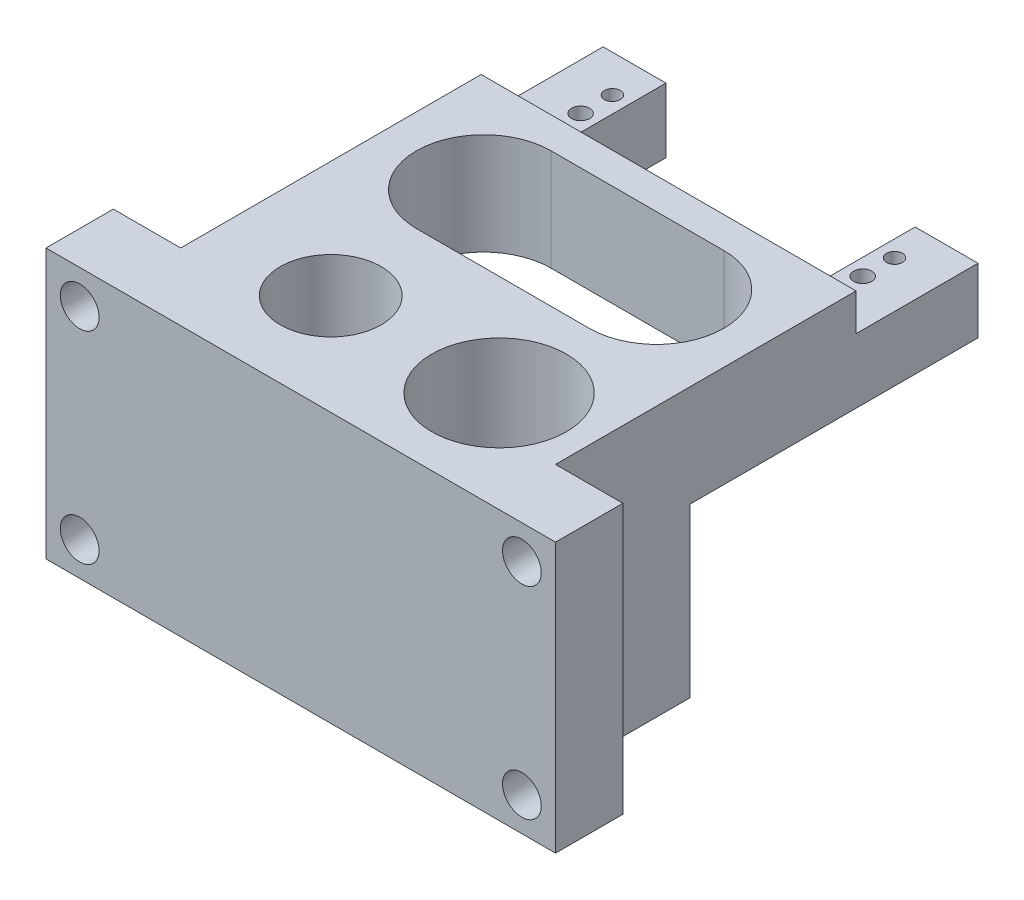
ISO-10303-21;
HEADER;
FILE_DESCRIPTION(('STEP AP214'),'2;1');
FILE_NAME('part.step','',(''),(''),'','','');
FILE_SCHEMA(('AUTOMOTIVE_DESIGN { 1 0 10303 214 1 1 1 1 }'));
ENDSEC;
DATA;
#1=APPLICATION_CONTEXT('core data for automotive mechanical design processes');
#2=APPLICATION_PROTOCOL_DEFINITION('international standard','automotive_design',2000,#1);
#3=PRODUCT_CONTEXT('',#1,'mechanical');
#4=PRODUCT('Part','Part','',(#3));
#5=PRODUCT_RELATED_PRODUCT_CATEGORY('part','',(#4));
#6=PRODUCT_DEFINITION_FORMATION('','',#4);
#7=PRODUCT_DEFINITION_CONTEXT('part definition',#1,'design');
#8=PRODUCT_DEFINITION('design','',#6,#7);
#9=PRODUCT_DEFINITION_SHAPE('','',#8);
#10=(LENGTH_UNIT() NAMED_UNIT(*) SI_UNIT(.MILLI.,.METRE.));
#11=(NAMED_UNIT(*) PLANE_ANGLE_UNIT() SI_UNIT($,.RADIAN.));
#12=(NAMED_UNIT(*) SI_UNIT($,.STERADIAN.) SOLID_ANGLE_UNIT());
#13=UNCERTAINTY_MEASURE_WITH_UNIT(LENGTH_MEASURE(1.E-05),#10,'distance_accuracy_value','');
#14=(GEOMETRIC_REPRESENTATION_CONTEXT(3) GLOBAL_UNCERTAINTY_ASSIGNED_CONTEXT((#13)) GLOBAL_UNIT_ASSIGNED_CONTEXT((#10,
#11,#12)) REPRESENTATION_CONTEXT('',''));
#15=CARTESIAN_POINT('',(0.,0.,0.));
#16=DIRECTION('',(0.,0.,1.));
#17=DIRECTION('',(1.,0.,0.));
#18=AXIS2_PLACEMENT_3D('',#15,#16,#17);
#19=CARTESIAN_POINT('',(0.,0.,-25.1625));
#20=DIRECTION('',(0.,0.,1.));
#21=DIRECTION('',(1.,0.,0.));
#22=AXIS2_PLACEMENT_3D('',#19,#20,#21);
#23=PLANE('',#22);
#24=DIRECTION('',(1.,0.,0.));
#25=VECTOR('',#24,1.);
#26=CARTESIAN_POINT('',(-5.05000000000001,21.9085,-25.1625));
#27=LINE('',#26,#25);
#28=CARTESIAN_POINT('',(-10.975,21.9085,-25.1625));
#29=VERTEX_POINT('',#28);
#30=CARTESIAN_POINT('',(-5.05000000000001,21.9085,-25.1625));
#31=VERTEX_POINT('',#30);
#32=EDGE_CURVE('E69',#29,#31,#27,.T.);
#33=ORIENTED_EDGE('',*,*,#32,.F.);
#34=DIRECTION('',(0.,1.,0.));
#35=VECTOR('',#34,1.);
#36=CARTESIAN_POINT('',(-10.975,25.4,-25.1625));
#37=LINE('',#36,#35);
#38=CARTESIAN_POINT('',(-10.975,25.4,-25.1625));
#39=VERTEX_POINT('',#38);
#40=EDGE_CURVE('E359',#29,#39,#37,.T.);
#41=ORIENTED_EDGE('',*,*,#40,.T.);
#42=DIRECTION('',(1.,0.,0.));
#43=VECTOR('',#42,1.);
#44=CARTESIAN_POINT('',(24.375,25.4,-25.1625));
#45=LINE('',#44,#43);
#46=CARTESIAN_POINT('',(24.375,25.4,-25.1625));
#47=VERTEX_POINT('',#46);
#48=EDGE_CURVE('E362',#39,#47,#45,.T.);
#49=ORIENTED_EDGE('',*,*,#48,.T.);
#50=DIRECTION('',(0.,-1.,0.));
#51=VECTOR('',#50,1.);
#52=CARTESIAN_POINT('',(24.375,15.8125,-25.1625));
#53=LINE('',#52,#51);
#54=CARTESIAN_POINT('',(24.375,21.9085,-25.1625));
#55=VERTEX_POINT('',#54);
#56=EDGE_CURVE('E365',#47,#55,#53,.T.);
#57=ORIENTED_EDGE('',*,*,#56,.T.);
#58=DIRECTION('',(1.,0.,0.));
#59=VECTOR('',#58,1.);
#60=CARTESIAN_POINT('',(24.375,21.9085,-25.1625));
#61=LINE('',#60,#59);
#62=CARTESIAN_POINT('',(18.45,21.9085,-25.1625));
#63=VERTEX_POINT('',#62);
#64=EDGE_CURVE('E289',#63,#55,#61,.T.);
#65=ORIENTED_EDGE('',*,*,#64,.F.);
#66=DIRECTION('',(0.,1.,0.));
#67=VECTOR('',#66,1.);
#68=CARTESIAN_POINT('',(18.45,21.9085,-25.1625));
#69=LINE('',#68,#67);
#70=CARTESIAN_POINT('',(18.45,15.8125,-25.1625));
#71=VERTEX_POINT('',#70);
#72=EDGE_CURVE('E284',#71,#63,#69,.T.);
#73=ORIENTED_EDGE('',*,*,#72,.F.);
#74=DIRECTION('',(-1.,0.,0.));
#75=VECTOR('',#74,1.);
#76=CARTESIAN_POINT('',(-10.975,15.8125,-25.1625));
#77=LINE('',#76,#75);
#78=CARTESIAN_POINT('',(-5.05000000000001,15.8125,-25.1625));
#79=VERTEX_POINT('',#78);
#80=EDGE_CURVE('E357',#71,#79,#77,.T.);
#81=ORIENTED_EDGE('',*,*,#80,.T.);
#82=DIRECTION('',(0.,-1.,0.));
#83=VECTOR('',#82,1.);
#84=CARTESIAN_POINT('',(-5.05000000000001,15.8125,-25.1625));
#85=LINE('',#84,#83);
#86=EDGE_CURVE('E64',#31,#79,#85,.T.);
#87=ORIENTED_EDGE('',*,*,#86,.F.);
#88=EDGE_LOOP('',(#33,#41,#49,#57,#65,#73,#81,#87));
#89=FACE_BOUND('',#88,.T.);
#90=ADVANCED_FACE('F46',(#89),#23,.F.);
#91=CARTESIAN_POINT('',(24.375,25.4,-16.74375));
#92=DIRECTION('',(-1.,0.,0.));
#93=DIRECTION('',(0.,0.,1.));
#94=AXIS2_PLACEMENT_3D('',#91,#92,#93);
#95=PLANE('',#94);
#96=DIRECTION('',(0.,0.,1.));
#97=VECTOR('',#96,1.);
#98=CARTESIAN_POINT('',(24.375,15.8125,-16.74375));
#99=LINE('',#98,#97);
#100=CARTESIAN_POINT('',(24.375,15.8125,-36.6625));
#101=VERTEX_POINT('',#100);
#102=CARTESIAN_POINT('',(24.375,15.8125,-9.525));
#103=VERTEX_POINT('',#102);
#104=EDGE_CURVE('E400',#101,#103,#99,.T.);
#105=ORIENTED_EDGE('',*,*,#104,.F.);
#106=DIRECTION('',(0.,-1.,0.));
#107=VECTOR('',#106,1.);
#108=CARTESIAN_POINT('',(24.375,15.8125,-36.6625));
#109=LINE('',#108,#107);
#110=CARTESIAN_POINT('',(24.375,21.9085,-36.6625));
#111=VERTEX_POINT('',#110);
#112=EDGE_CURVE('E285',#111,#101,#109,.T.);
#113=ORIENTED_EDGE('',*,*,#112,.F.);
#114=DIRECTION('',(0.,0.,1.));
#115=VECTOR('',#114,1.);
#116=CARTESIAN_POINT('',(24.375,21.9085,-36.6625));
#117=LINE('',#116,#115);
#118=EDGE_CURVE('E295',#111,#55,#117,.T.);
#119=ORIENTED_EDGE('',*,*,#118,.T.);
#120=ORIENTED_EDGE('',*,*,#56,.F.);
#121=DIRECTION('',(0.,0.,-1.));
#122=VECTOR('',#121,1.);
#123=CARTESIAN_POINT('',(24.375,25.4,-13.56875));
#124=LINE('',#123,#122);
#125=CARTESIAN_POINT('',(24.375,25.4,3.175));
#126=VERTEX_POINT('',#125);
#127=EDGE_CURVE('E378',#47,#126,#124,.F.);
#128=ORIENTED_EDGE('',*,*,#127,.T.);
#129=DIRECTION('',(0.,1.,0.));
#130=VECTOR('',#129,1.);
#131=CARTESIAN_POINT('',(24.375,25.4,3.175));
#132=LINE('',#131,#130);
#133=CARTESIAN_POINT('',(24.375,0.,3.17499999999999));
#134=VERTEX_POINT('',#133);
#135=EDGE_CURVE('E396',#126,#134,#132,.F.);
#136=ORIENTED_EDGE('',*,*,#135,.T.);
#137=DIRECTION('',(0.,0.,1.));
#138=VECTOR('',#137,1.);
#139=CARTESIAN_POINT('',(24.375,0.,3.17499999999999));
#140=LINE('',#139,#138);
#141=CARTESIAN_POINT('',(24.375,0.,-9.52500000000001));
#142=VERTEX_POINT('',#141);
#143=EDGE_CURVE('E346',#142,#134,#140,.T.);
#144=ORIENTED_EDGE('',*,*,#143,.F.);
#145=DIRECTION('',(0.,1.,0.));
#146=VECTOR('',#145,1.);
#147=CARTESIAN_POINT('',(24.375,0.,-9.52500000000001));
#148=LINE('',#147,#146);
#149=EDGE_CURVE('E348',#142,#103,#148,.T.);
#150=ORIENTED_EDGE('',*,*,#149,.T.);
#151=EDGE_LOOP('',(#105,#113,#119,#120,#128,#136,#144,#150));
#152=FACE_BOUND('',#151,.T.);
#153=ADVANCED_FACE('F541',(#152),#95,.F.);
#154=CARTESIAN_POINT('',(-10.975,25.4,-16.74375));
#155=DIRECTION('',(-1.,0.,0.));
#156=DIRECTION('',(0.,0.,1.));
#157=AXIS2_PLACEMENT_3D('',#154,#155,#156);
#158=PLANE('',#157);
#159=DIRECTION('',(0.,0.,-1.));
#160=VECTOR('',#159,1.);
#161=CARTESIAN_POINT('',(-10.975,25.4,-13.56875));
#162=LINE('',#161,#160);
#163=CARTESIAN_POINT('',(-10.975,25.4,3.175));
#164=VERTEX_POINT('',#163);
#165=EDGE_CURVE('E393',#164,#39,#162,.T.);
#166=ORIENTED_EDGE('',*,*,#165,.T.);
#167=ORIENTED_EDGE('',*,*,#40,.F.);
#168=DIRECTION('',(0.,0.,1.));
#169=VECTOR('',#168,1.);
#170=CARTESIAN_POINT('',(-10.975,21.9085,-36.6625));
#171=LINE('',#170,#169);
#172=CARTESIAN_POINT('',(-10.975,21.9085,-36.6625));
#173=VERTEX_POINT('',#172);
#174=EDGE_CURVE('E274',#173,#29,#171,.T.);
#175=ORIENTED_EDGE('',*,*,#174,.F.);
#176=DIRECTION('',(0.,1.,0.));
#177=VECTOR('',#176,1.);
#178=CARTESIAN_POINT('',(-10.975,21.9085,-36.6625));
#179=LINE('',#178,#177);
#180=CARTESIAN_POINT('',(-10.975,15.8125,-36.6625));
#181=VERTEX_POINT('',#180);
#182=EDGE_CURVE('E272',#181,#173,#179,.T.);
#183=ORIENTED_EDGE('',*,*,#182,.F.);
#184=DIRECTION('',(0.,0.,1.));
#185=VECTOR('',#184,1.);
#186=CARTESIAN_POINT('',(-10.975,15.8125,-16.74375));
#187=LINE('',#186,#185);
#188=CARTESIAN_POINT('',(-10.975,15.8125,-9.525));
#189=VERTEX_POINT('',#188);
#190=EDGE_CURVE('E394',#181,#189,#187,.T.);
#191=ORIENTED_EDGE('',*,*,#190,.T.);
#192=DIRECTION('',(0.,1.,0.));
#193=VECTOR('',#192,1.);
#194=CARTESIAN_POINT('',(-10.975,0.,-9.52500000000001));
#195=LINE('',#194,#193);
#196=CARTESIAN_POINT('',(-10.975,0.,-9.52500000000001));
#197=VERTEX_POINT('',#196);
#198=EDGE_CURVE('E353',#197,#189,#195,.T.);
#199=ORIENTED_EDGE('',*,*,#198,.F.);
#200=DIRECTION('',(0.,0.,-1.));
#201=VECTOR('',#200,1.);
#202=CARTESIAN_POINT('',(-10.975,0.,-9.52500000000001));
#203=LINE('',#202,#201);
#204=CARTESIAN_POINT('',(-10.975,0.,3.175));
#205=VERTEX_POINT('',#204);
#206=EDGE_CURVE('E341',#205,#197,#203,.T.);
#207=ORIENTED_EDGE('',*,*,#206,.F.);
#208=DIRECTION('',(0.,1.,0.));
#209=VECTOR('',#208,1.);
#210=CARTESIAN_POINT('',(-10.975,25.4,3.175));
#211=LINE('',#210,#209);
#212=EDGE_CURVE('E388',#205,#164,#211,.T.);
#213=ORIENTED_EDGE('',*,*,#212,.T.);
#214=EDGE_LOOP('',(#166,#167,#175,#183,#191,#199,#207,#213));
#215=FACE_BOUND('',#214,.T.);
#216=ADVANCED_FACE('F551',(#215),#158,.T.);
#217=CARTESIAN_POINT('',(50.8,7.90625,-9.525));
#218=DIRECTION('',(0.,0.,1.));
#219=DIRECTION('',(1.,0.,0.));
#220=AXIS2_PLACEMENT_3D('',#217,#218,#219);
#221=PLANE('',#220);
#222=DIRECTION('',(0.,1.,0.));
#223=VECTOR('',#222,1.);
#224=CARTESIAN_POINT('',(14.85,7.90625,-9.525));
#225=LINE('',#224,#223);
#226=CARTESIAN_POINT('',(14.85,15.8125,-9.525));
#227=VERTEX_POINT('',#226);
#228=CARTESIAN_POINT('',(14.85,25.4,-9.525));
#229=VERTEX_POINT('',#228);
#230=EDGE_CURVE('E514',#227,#229,#225,.T.);
#231=ORIENTED_EDGE('',*,*,#230,.F.);
#232=DIRECTION('',(1.,0.,0.));
#233=VECTOR('',#232,1.);
#234=CARTESIAN_POINT('',(24.375,15.8125,-9.525));
#235=LINE('',#234,#233);
#236=EDGE_CURVE('E12',#227,#103,#235,.T.);
#237=ORIENTED_EDGE('',*,*,#236,.T.);
#238=ORIENTED_EDGE('',*,*,#149,.F.);
#239=DIRECTION('',(1.,0.,0.));
#240=VECTOR('',#239,1.);
#241=CARTESIAN_POINT('',(24.375,0.,-9.52500000000001));
#242=LINE('',#241,#240);
#243=EDGE_CURVE('E344',#197,#142,#242,.T.);
#244=ORIENTED_EDGE('',*,*,#243,.F.);
#245=ORIENTED_EDGE('',*,*,#198,.T.);
#246=CARTESIAN_POINT('',(-1.45,15.8125,-9.525));
#247=VERTEX_POINT('',#246);
#248=EDGE_CURVE('E57',#189,#247,#235,.T.);
#249=ORIENTED_EDGE('',*,*,#248,.T.);
#250=DIRECTION('',(0.,1.,0.));
#251=VECTOR('',#250,1.);
#252=CARTESIAN_POINT('',(-1.45,7.90625,-9.525));
#253=LINE('',#252,#251);
#254=CARTESIAN_POINT('',(-1.45,25.4,-9.525));
#255=VERTEX_POINT('',#254);
#256=EDGE_CURVE('E517',#255,#247,#253,.F.);
#257=ORIENTED_EDGE('',*,*,#256,.F.);
#258=DIRECTION('',(1.,0.,0.));
#259=VECTOR('',#258,1.);
#260=CARTESIAN_POINT('',(6.7,25.4,-9.525));
#261=LINE('',#260,#259);
#262=EDGE_CURVE('E372',#255,#229,#261,.T.);
#263=ORIENTED_EDGE('',*,*,#262,.T.);
#264=EDGE_LOOP('',(#231,#237,#238,#244,#245,#249,#257,#263));
#265=FACE_BOUND('',#264,.T.);
#266=ADVANCED_FACE('F539',(#265),#221,.F.);
#267=CARTESIAN_POINT('',(50.8,15.8125,-23.09375));
#268=DIRECTION('',(0.,-1.,0.));
#269=DIRECTION('',(0.,0.,-1.));
#270=AXIS2_PLACEMENT_3D('',#267,#268,#269);
#271=PLANE('',#270);
#272=CARTESIAN_POINT('',(20.,15.8125,-33.1625));
#273=DIRECTION('',(0.,-1.,0.));
#274=DIRECTION('',(0.,0.,-1.));
#275=AXIS2_PLACEMENT_3D('',#272,#273,#274);
#276=CIRCLE('',#275,0.749999999999989);
#277=CARTESIAN_POINT('',(20.,15.8125,-33.9125));
#278=VERTEX_POINT('',#277);
#279=EDGE_CURVE('E50',#278,#278,#276,.T.);
#280=ORIENTED_EDGE('',*,*,#279,.F.);
#281=EDGE_LOOP('',(#280));
#282=FACE_BOUND('',#281,.T.);
#283=CARTESIAN_POINT('',(-6.6,15.8125,-33.1625));
#284=DIRECTION('',(0.,-1.,0.));
#285=DIRECTION('',(0.,0.,-1.));
#286=AXIS2_PLACEMENT_3D('',#283,#284,#285);
#287=CIRCLE('',#286,0.749999999999987);
#288=CARTESIAN_POINT('',(-6.6,15.8125,-33.9125));
#289=VERTEX_POINT('',#288);
#290=EDGE_CURVE('E645',#289,#289,#287,.T.);
#291=ORIENTED_EDGE('',*,*,#290,.F.);
#292=EDGE_LOOP('',(#291));
#293=FACE_BOUND('',#292,.T.);
#294=CARTESIAN_POINT('',(20.,15.8125,-30.1625));
#295=DIRECTION('',(0.,-1.,0.));
#296=DIRECTION('',(0.,0.,-1.));
#297=AXIS2_PLACEMENT_3D('',#294,#295,#296);
#298=CIRCLE('',#297,0.849999999999986);
#299=CARTESIAN_POINT('',(20.,15.8125,-31.0124999999999));
#300=VERTEX_POINT('',#299);
#301=EDGE_CURVE('E649',#300,#300,#298,.T.);
#302=ORIENTED_EDGE('',*,*,#301,.F.);
#303=EDGE_LOOP('',(#302));
#304=FACE_BOUND('',#303,.T.);
#305=CARTESIAN_POINT('',(-6.6,15.8125,-30.1625));
#306=DIRECTION('',(0.,-1.,0.));
#307=DIRECTION('',(0.,0.,-1.));
#308=AXIS2_PLACEMENT_3D('',#305,#306,#307);
#309=CIRCLE('',#308,0.849999999999988);
#310=CARTESIAN_POINT('',(-6.6,15.8125,-31.0124999999999));
#311=VERTEX_POINT('',#310);
#312=EDGE_CURVE('E652',#311,#311,#309,.T.);
#313=ORIENTED_EDGE('',*,*,#312,.F.);
#314=EDGE_LOOP('',(#313));
#315=FACE_BOUND('',#314,.T.);
#316=ORIENTED_EDGE('',*,*,#248,.F.);
#317=ORIENTED_EDGE('',*,*,#190,.F.);
#318=DIRECTION('',(-1.,0.,0.));
#319=VECTOR('',#318,1.);
#320=CARTESIAN_POINT('',(-10.975,15.8125,-36.6625));
#321=LINE('',#320,#319);
#322=CARTESIAN_POINT('',(-5.05000000000001,15.8125,-36.6625));
#323=VERTEX_POINT('',#322);
#324=EDGE_CURVE('E269',#323,#181,#321,.T.);
#325=ORIENTED_EDGE('',*,*,#324,.F.);
#326=DIRECTION('',(0.,0.,1.));
#327=VECTOR('',#326,1.);
#328=CARTESIAN_POINT('',(-5.05000000000001,15.8125,-36.6625));
#329=LINE('',#328,#327);
#330=EDGE_CURVE('E279',#323,#79,#329,.T.);
#331=ORIENTED_EDGE('',*,*,#330,.T.);
#332=ORIENTED_EDGE('',*,*,#80,.F.);
#333=DIRECTION('',(0.,0.,1.));
#334=VECTOR('',#333,1.);
#335=CARTESIAN_POINT('',(18.45,15.8125,-36.6625));
#336=LINE('',#335,#334);
#337=CARTESIAN_POINT('',(18.45,15.8125,-36.6625));
#338=VERTEX_POINT('',#337);
#339=EDGE_CURVE('E305',#338,#71,#336,.T.);
#340=ORIENTED_EDGE('',*,*,#339,.F.);
#341=DIRECTION('',(-1.,0.,0.));
#342=VECTOR('',#341,1.);
#343=CARTESIAN_POINT('',(18.45,15.8125,-36.6625));
#344=LINE('',#343,#342);
#345=EDGE_CURVE('E288',#101,#338,#344,.T.);
#346=ORIENTED_EDGE('',*,*,#345,.F.);
#347=ORIENTED_EDGE('',*,*,#104,.T.);
#348=ORIENTED_EDGE('',*,*,#236,.F.);
#349=CARTESIAN_POINT('',(14.85,15.8125,-15.875));
#350=DIRECTION('',(0.,-1.,0.));
#351=DIRECTION('',(0.,0.,-1.));
#352=AXIS2_PLACEMENT_3D('',#349,#350,#351);
#353=CIRCLE('',#352,6.35);
#354=CARTESIAN_POINT('',(14.85,15.8125,-22.225));
#355=VERTEX_POINT('',#354);
#356=EDGE_CURVE('E407',#227,#355,#353,.F.);
#357=ORIENTED_EDGE('',*,*,#356,.T.);
#358=DIRECTION('',(-1.,0.,0.));
#359=VECTOR('',#358,1.);
#360=CARTESIAN_POINT('',(-10.975,15.8125,-22.225));
#361=LINE('',#360,#359);
#362=CARTESIAN_POINT('',(-1.45,15.8125,-22.225));
#363=VERTEX_POINT('',#362);
#364=EDGE_CURVE('E356',#355,#363,#361,.T.);
#365=ORIENTED_EDGE('',*,*,#364,.T.);
#366=CARTESIAN_POINT('',(-1.45,15.8125,-15.875));
#367=DIRECTION('',(0.,-1.,0.));
#368=DIRECTION('',(0.,0.,-1.));
#369=AXIS2_PLACEMENT_3D('',#366,#367,#368);
#370=CIRCLE('',#369,6.35);
#371=EDGE_CURVE('E367',#363,#247,#370,.F.);
#372=ORIENTED_EDGE('',*,*,#371,.T.);
#373=EDGE_LOOP('',(#316,#317,#325,#331,#332,#340,#346,#347,#348,#357,#365,#372));
#374=FACE_BOUND('',#373,.T.);
#375=ADVANCED_FACE('F48',(#282,#293,#304,#315,#374),#271,.T.);
#376=CARTESIAN_POINT('',(-1.45,87.8064131172225,-15.875));
#377=DIRECTION('',(0.,-1.,0.));
#378=DIRECTION('',(0.,0.,-1.));
#379=AXIS2_PLACEMENT_3D('',#376,#377,#378);
#380=CYLINDRICAL_SURFACE('',#379,6.35);
#381=CARTESIAN_POINT('',(-1.45,25.4,-15.875));
#382=DIRECTION('',(0.,-1.,0.));
#383=DIRECTION('',(0.,0.,-1.));
#384=AXIS2_PLACEMENT_3D('',#381,#382,#383);
#385=CIRCLE('',#384,6.35);
#386=CARTESIAN_POINT('',(-1.45,25.4,-22.225));
#387=VERTEX_POINT('',#386);
#388=EDGE_CURVE('E377',#387,#255,#385,.F.);
#389=ORIENTED_EDGE('',*,*,#388,.T.);
#390=ORIENTED_EDGE('',*,*,#256,.T.);
#391=ORIENTED_EDGE('',*,*,#371,.F.);
#392=DIRECTION('',(0.,1.,0.));
#393=VECTOR('',#392,1.);
#394=CARTESIAN_POINT('',(-1.45,87.8064131172225,-22.225));
#395=LINE('',#394,#393);
#396=EDGE_CURVE('E406',#387,#363,#395,.F.);
#397=ORIENTED_EDGE('',*,*,#396,.F.);
#398=EDGE_LOOP('',(#389,#390,#391,#397));
#399=FACE_BOUND('',#398,.T.);
#400=ADVANCED_FACE('F620',(#399),#380,.F.);
#401=CARTESIAN_POINT('',(14.85,87.8064131172225,-15.875));
#402=DIRECTION('',(0.,-1.,0.));
#403=DIRECTION('',(0.,0.,-1.));
#404=AXIS2_PLACEMENT_3D('',#401,#402,#403);
#405=CYLINDRICAL_SURFACE('',#404,6.35);
#406=ORIENTED_EDGE('',*,*,#230,.T.);
#407=CARTESIAN_POINT('',(14.85,25.4,-15.875));
#408=DIRECTION('',(0.,-1.,0.));
#409=DIRECTION('',(0.,0.,-1.));
#410=AXIS2_PLACEMENT_3D('',#407,#408,#409);
#411=CIRCLE('',#410,6.35);
#412=CARTESIAN_POINT('',(14.85,25.4,-22.225));
#413=VERTEX_POINT('',#412);
#414=EDGE_CURVE('E55',#229,#413,#411,.F.);
#415=ORIENTED_EDGE('',*,*,#414,.T.);
#416=DIRECTION('',(0.,1.,0.));
#417=VECTOR('',#416,1.);
#418=CARTESIAN_POINT('',(14.85,87.8064131172225,-22.225));
#419=LINE('',#418,#417);
#420=EDGE_CURVE('E401',#355,#413,#419,.T.);
#421=ORIENTED_EDGE('',*,*,#420,.F.);
#422=ORIENTED_EDGE('',*,*,#356,.F.);
#423=EDGE_LOOP('',(#406,#415,#421,#422));
#424=FACE_BOUND('',#423,.T.);
#425=ADVANCED_FACE('F623',(#424),#405,.F.);
#426=CARTESIAN_POINT('',(6.7,25.4,-13.56875));
#427=DIRECTION('',(0.,-1.,0.));
#428=DIRECTION('',(0.,0.,-1.));
#429=AXIS2_PLACEMENT_3D('',#426,#427,#428);
#430=PLANE('',#429);
#431=CARTESIAN_POINT('',(15.875,25.4,0.));
#432=DIRECTION('',(0.,-1.,0.));
#433=DIRECTION('',(0.,0.,-1.));
#434=AXIS2_PLACEMENT_3D('',#431,#432,#433);
#435=CIRCLE('',#434,6.35000000000001);
#436=CARTESIAN_POINT('',(15.875,25.4,-6.35000000000001));
#437=VERTEX_POINT('',#436);
#438=EDGE_CURVE('E233',#437,#437,#435,.T.);
#439=ORIENTED_EDGE('',*,*,#438,.T.);
#440=EDGE_LOOP('',(#439));
#441=FACE_BOUND('',#440,.T.);
#442=CARTESIAN_POINT('',(0.,25.4,0.));
#443=DIRECTION('',(0.,1.,0.));
#444=DIRECTION('',(0.,0.,1.));
#445=AXIS2_PLACEMENT_3D('',#442,#443,#444);
#446=CIRCLE('',#445,4.76249999999999);
#447=CARTESIAN_POINT('',(0.,25.4,4.76249999999999));
#448=VERTEX_POINT('',#447);
#449=EDGE_CURVE('E236',#448,#448,#446,.T.);
#450=ORIENTED_EDGE('',*,*,#449,.F.);
#451=EDGE_LOOP('',(#450));
#452=FACE_BOUND('',#451,.T.);
#453=ORIENTED_EDGE('',*,*,#388,.F.);
#454=DIRECTION('',(1.,0.,0.));
#455=VECTOR('',#454,1.);
#456=CARTESIAN_POINT('',(24.375,25.4,-22.225));
#457=LINE('',#456,#455);
#458=EDGE_CURVE('E360',#387,#413,#457,.T.);
#459=ORIENTED_EDGE('',*,*,#458,.T.);
#460=ORIENTED_EDGE('',*,*,#414,.F.);
#461=ORIENTED_EDGE('',*,*,#262,.F.);
#462=EDGE_LOOP('',(#453,#459,#460,#461));
#463=FACE_BOUND('',#462,.T.);
#464=ORIENTED_EDGE('',*,*,#127,.F.);
#465=ORIENTED_EDGE('',*,*,#48,.F.);
#466=ORIENTED_EDGE('',*,*,#165,.F.);
#467=DIRECTION('',(-1.,0.,0.));
#468=VECTOR('',#467,1.);
#469=CARTESIAN_POINT('',(-17.325,25.4,3.175));
#470=LINE('',#469,#468);
#471=CARTESIAN_POINT('',(-17.325,25.4,3.175));
#472=VERTEX_POINT('',#471);
#473=EDGE_CURVE('E308',#164,#472,#470,.T.);
#474=ORIENTED_EDGE('',*,*,#473,.T.);
#475=DIRECTION('',(0.,0.,-1.));
#476=VECTOR('',#475,1.);
#477=CARTESIAN_POINT('',(-17.325,25.4,9.525));
#478=LINE('',#477,#476);
#479=CARTESIAN_POINT('',(-17.325,25.4,9.525));
#480=VERTEX_POINT('',#479);
#481=EDGE_CURVE('E338',#480,#472,#478,.T.);
#482=ORIENTED_EDGE('',*,*,#481,.F.);
#483=DIRECTION('',(-1.,0.,0.));
#484=VECTOR('',#483,1.);
#485=CARTESIAN_POINT('',(-17.325,25.4,9.525));
#486=LINE('',#485,#484);
#487=CARTESIAN_POINT('',(30.725,25.4,9.525));
#488=VERTEX_POINT('',#487);
#489=EDGE_CURVE('E309',#488,#480,#486,.T.);
#490=ORIENTED_EDGE('',*,*,#489,.F.);
#491=DIRECTION('',(0.,0.,-1.));
#492=VECTOR('',#491,1.);
#493=CARTESIAN_POINT('',(30.725,25.4,9.525));
#494=LINE('',#493,#492);
#495=CARTESIAN_POINT('',(30.725,25.4,3.175));
#496=VERTEX_POINT('',#495);
#497=EDGE_CURVE('E319',#488,#496,#494,.T.);
#498=ORIENTED_EDGE('',*,*,#497,.T.);
#499=EDGE_CURVE('E320',#496,#126,#470,.T.);
#500=ORIENTED_EDGE('',*,*,#499,.T.);
#501=EDGE_LOOP('',(#464,#465,#466,#474,#482,#490,#498,#500));
#502=FACE_BOUND('',#501,.T.);
#503=ADVANCED_FACE('F576',(#441,#452,#463,#502),#430,.F.);
#504=CARTESIAN_POINT('',(0.,0.,-22.225));
#505=DIRECTION('',(0.,0.,1.));
#506=DIRECTION('',(1.,0.,0.));
#507=AXIS2_PLACEMENT_3D('',#504,#505,#506);
#508=PLANE('',#507);
#509=ORIENTED_EDGE('',*,*,#396,.T.);
#510=ORIENTED_EDGE('',*,*,#364,.F.);
#511=ORIENTED_EDGE('',*,*,#420,.T.);
#512=ORIENTED_EDGE('',*,*,#458,.F.);
#513=EDGE_LOOP('',(#509,#510,#511,#512));
#514=FACE_BOUND('',#513,.T.);
#515=ADVANCED_FACE('F616',(#514),#508,.T.);
#516=CARTESIAN_POINT('',(0.,0.,0.));
#517=DIRECTION('',(0.,1.,0.));
#518=DIRECTION('',(0.,0.,1.));
#519=AXIS2_PLACEMENT_3D('',#516,#517,#518);
#520=PLANE('',#519);
#521=CARTESIAN_POINT('',(-9.705,0.,6.35));
#522=DIRECTION('',(0.,-1.,0.));
#523=DIRECTION('',(0.,0.,-1.));
#524=AXIS2_PLACEMENT_3D('',#521,#522,#523);
#525=CIRCLE('',#524,0.888999999999989);
#526=CARTESIAN_POINT('',(-9.705,0.,5.46100000000001));
#527=VERTEX_POINT('',#526);
#528=EDGE_CURVE('E206',#527,#527,#525,.T.);
#529=ORIENTED_EDGE('',*,*,#528,.F.);
#530=EDGE_LOOP('',(#529));
#531=FACE_BOUND('',#530,.T.);
#532=CARTESIAN_POINT('',(-8.475,0.,-6.525));
#533=DIRECTION('',(0.,-1.,0.));
#534=DIRECTION('',(0.,0.,-1.));
#535=AXIS2_PLACEMENT_3D('',#532,#533,#534);
#536=CIRCLE('',#535,0.888999999999989);
#537=CARTESIAN_POINT('',(-8.475,0.,-7.41399999999999));
#538=VERTEX_POINT('',#537);
#539=EDGE_CURVE('E205',#538,#538,#536,.T.);
#540=ORIENTED_EDGE('',*,*,#539,.F.);
#541=EDGE_LOOP('',(#540));
#542=FACE_BOUND('',#541,.T.);
#543=CARTESIAN_POINT('',(21.875,0.,-6.525));
#544=DIRECTION('',(0.,-1.,0.));
#545=DIRECTION('',(0.,0.,-1.));
#546=AXIS2_PLACEMENT_3D('',#543,#544,#545);
#547=CIRCLE('',#546,0.888999999999987);
#548=CARTESIAN_POINT('',(21.875,0.,-7.41399999999999));
#549=VERTEX_POINT('',#548);
#550=EDGE_CURVE('E218',#549,#549,#547,.T.);
#551=ORIENTED_EDGE('',*,*,#550,.F.);
#552=EDGE_LOOP('',(#551));
#553=FACE_BOUND('',#552,.T.);
#554=CARTESIAN_POINT('',(23.105,0.,6.35));
#555=DIRECTION('',(0.,-1.,0.));
#556=DIRECTION('',(0.,0.,-1.));
#557=AXIS2_PLACEMENT_3D('',#554,#555,#556);
#558=CIRCLE('',#557,0.888999999999987);
#559=CARTESIAN_POINT('',(23.105,0.,5.46100000000001));
#560=VERTEX_POINT('',#559);
#561=EDGE_CURVE('E224',#560,#560,#558,.T.);
#562=ORIENTED_EDGE('',*,*,#561,.F.);
#563=EDGE_LOOP('',(#562));
#564=FACE_BOUND('',#563,.T.);
#565=CARTESIAN_POINT('',(15.875,0.,0.));
#566=DIRECTION('',(0.,-1.,0.));
#567=DIRECTION('',(0.,0.,-1.));
#568=AXIS2_PLACEMENT_3D('',#565,#566,#567);
#569=CIRCLE('',#568,6.35000000000002);
#570=CARTESIAN_POINT('',(15.875,0.,-6.35000000000001));
#571=VERTEX_POINT('',#570);
#572=EDGE_CURVE('E230',#571,#571,#569,.T.);
#573=ORIENTED_EDGE('',*,*,#572,.F.);
#574=EDGE_LOOP('',(#573));
#575=FACE_BOUND('',#574,.T.);
#576=CARTESIAN_POINT('',(0.,0.,0.));
#577=DIRECTION('',(0.,1.,0.));
#578=DIRECTION('',(0.,0.,1.));
#579=AXIS2_PLACEMENT_3D('',#576,#577,#578);
#580=CIRCLE('',#579,4.76249999999999);
#581=CARTESIAN_POINT('',(0.,0.,4.76249999999999));
#582=VERTEX_POINT('',#581);
#583=EDGE_CURVE('E239',#582,#582,#580,.T.);
#584=ORIENTED_EDGE('',*,*,#583,.T.);
#585=EDGE_LOOP('',(#584));
#586=FACE_BOUND('',#585,.T.);
#587=ORIENTED_EDGE('',*,*,#206,.T.);
#588=ORIENTED_EDGE('',*,*,#243,.T.);
#589=ORIENTED_EDGE('',*,*,#143,.T.);
#590=DIRECTION('',(1.,0.,0.));
#591=VECTOR('',#590,1.);
#592=CARTESIAN_POINT('',(30.725,0.,3.175));
#593=LINE('',#592,#591);
#594=CARTESIAN_POINT('',(30.725,0.,3.175));
#595=VERTEX_POINT('',#594);
#596=EDGE_CURVE('E325',#134,#595,#593,.T.);
#597=ORIENTED_EDGE('',*,*,#596,.T.);
#598=DIRECTION('',(0.,0.,-1.));
#599=VECTOR('',#598,1.);
#600=CARTESIAN_POINT('',(30.725,0.,9.525));
#601=LINE('',#600,#599);
#602=CARTESIAN_POINT('',(30.725,0.,9.525));
#603=VERTEX_POINT('',#602);
#604=EDGE_CURVE('E332',#603,#595,#601,.T.);
#605=ORIENTED_EDGE('',*,*,#604,.F.);
#606=DIRECTION('',(1.,0.,0.));
#607=VECTOR('',#606,1.);
#608=CARTESIAN_POINT('',(30.725,0.,9.525));
#609=LINE('',#608,#607);
#610=CARTESIAN_POINT('',(-17.325,0.,9.525));
#611=VERTEX_POINT('',#610);
#612=EDGE_CURVE('E315',#611,#603,#609,.T.);
#613=ORIENTED_EDGE('',*,*,#612,.F.);
#614=DIRECTION('',(0.,0.,-1.));
#615=VECTOR('',#614,1.);
#616=CARTESIAN_POINT('',(-17.325,0.,9.525));
#617=LINE('',#616,#615);
#618=CARTESIAN_POINT('',(-17.325,0.,3.175));
#619=VERTEX_POINT('',#618);
#620=EDGE_CURVE('E335',#611,#619,#617,.T.);
#621=ORIENTED_EDGE('',*,*,#620,.T.);
#622=EDGE_CURVE('E326',#619,#205,#593,.T.);
#623=ORIENTED_EDGE('',*,*,#622,.T.);
#624=EDGE_LOOP('',(#587,#588,#589,#597,#605,#613,#621,#623));
#625=FACE_BOUND('',#624,.T.);
#626=ADVANCED_FACE('F544',(#531,#542,#553,#564,#575,#586,#625),#520,.F.);
#627=CARTESIAN_POINT('',(0.,0.,3.175));
#628=DIRECTION('',(0.,0.,-1.));
#629=DIRECTION('',(-1.,0.,0.));
#630=AXIS2_PLACEMENT_3D('',#627,#628,#629);
#631=PLANE('',#630);
#632=CARTESIAN_POINT('',(-14.15,3.175,3.175));
#633=DIRECTION('',(0.,0.,-1.));
#634=DIRECTION('',(-1.,0.,0.));
#635=AXIS2_PLACEMENT_3D('',#632,#633,#634);
#636=CIRCLE('',#635,1.82880000000001);
#637=CARTESIAN_POINT('',(-15.9788,3.175,3.175));
#638=VERTEX_POINT('',#637);
#639=EDGE_CURVE('E242',#638,#638,#636,.T.);
#640=ORIENTED_EDGE('',*,*,#639,.F.);
#641=EDGE_LOOP('',(#640));
#642=FACE_BOUND('',#641,.T.);
#643=CARTESIAN_POINT('',(-14.15,22.225,3.175));
#644=DIRECTION('',(0.,0.,-1.));
#645=DIRECTION('',(-1.,0.,0.));
#646=AXIS2_PLACEMENT_3D('',#643,#644,#645);
#647=CIRCLE('',#646,1.82880000000001);
#648=CARTESIAN_POINT('',(-15.9788,22.225,3.175));
#649=VERTEX_POINT('',#648);
#650=EDGE_CURVE('E248',#649,#649,#647,.T.);
#651=ORIENTED_EDGE('',*,*,#650,.F.);
#652=EDGE_LOOP('',(#651));
#653=FACE_BOUND('',#652,.T.);
#654=ORIENTED_EDGE('',*,*,#212,.F.);
#655=ORIENTED_EDGE('',*,*,#622,.F.);
#656=DIRECTION('',(0.,-1.,0.));
#657=VECTOR('',#656,1.);
#658=CARTESIAN_POINT('',(-17.325,0.,3.175));
#659=LINE('',#658,#657);
#660=EDGE_CURVE('E323',#472,#619,#659,.T.);
#661=ORIENTED_EDGE('',*,*,#660,.F.);
#662=ORIENTED_EDGE('',*,*,#473,.F.);
#663=EDGE_LOOP('',(#654,#655,#661,#662));
#664=FACE_BOUND('',#663,.T.);
#665=ADVANCED_FACE('F761',(#642,#653,#664),#631,.T.);
#666=CARTESIAN_POINT('',(27.55,22.225,3.175));
#667=DIRECTION('',(0.,0.,-1.));
#668=DIRECTION('',(-1.,0.,0.));
#669=AXIS2_PLACEMENT_3D('',#666,#667,#668);
#670=CIRCLE('',#669,1.82880000000001);
#671=CARTESIAN_POINT('',(25.7212,22.225,3.175));
#672=VERTEX_POINT('',#671);
#673=EDGE_CURVE('E257',#672,#672,#670,.T.);
#674=ORIENTED_EDGE('',*,*,#673,.F.);
#675=EDGE_LOOP('',(#674));
#676=FACE_BOUND('',#675,.T.);
#677=CARTESIAN_POINT('',(27.55,3.175,3.175));
#678=DIRECTION('',(0.,0.,-1.));
#679=DIRECTION('',(-1.,0.,0.));
#680=AXIS2_PLACEMENT_3D('',#677,#678,#679);
#681=CIRCLE('',#680,1.82880000000001);
#682=CARTESIAN_POINT('',(25.7212,3.175,3.175));
#683=VERTEX_POINT('',#682);
#684=EDGE_CURVE('E261',#683,#683,#681,.T.);
#685=ORIENTED_EDGE('',*,*,#684,.F.);
#686=EDGE_LOOP('',(#685));
#687=FACE_BOUND('',#686,.T.);
#688=ORIENTED_EDGE('',*,*,#135,.F.);
#689=ORIENTED_EDGE('',*,*,#499,.F.);
#690=DIRECTION('',(0.,1.,0.));
#691=VECTOR('',#690,1.);
#692=CARTESIAN_POINT('',(30.725,25.4,3.175));
#693=LINE('',#692,#691);
#694=EDGE_CURVE('E313',#595,#496,#693,.T.);
#695=ORIENTED_EDGE('',*,*,#694,.F.);
#696=ORIENTED_EDGE('',*,*,#596,.F.);
#697=EDGE_LOOP('',(#688,#689,#695,#696));
#698=FACE_BOUND('',#697,.T.);
#699=ADVANCED_FACE('F759',(#676,#687,#698),#631,.T.);
#700=CARTESIAN_POINT('',(-17.325,0.,9.525));
#701=DIRECTION('',(1.,0.,0.));
#702=DIRECTION('',(0.,0.,-1.));
#703=AXIS2_PLACEMENT_3D('',#700,#701,#702);
#704=PLANE('',#703);
#705=ORIENTED_EDGE('',*,*,#660,.T.);
#706=ORIENTED_EDGE('',*,*,#620,.F.);
#707=DIRECTION('',(0.,-1.,0.));
#708=VECTOR('',#707,1.);
#709=CARTESIAN_POINT('',(-17.325,0.,9.525));
#710=LINE('',#709,#708);
#711=EDGE_CURVE('E312',#480,#611,#710,.T.);
#712=ORIENTED_EDGE('',*,*,#711,.F.);
#713=ORIENTED_EDGE('',*,*,#481,.T.);
#714=EDGE_LOOP('',(#705,#706,#712,#713));
#715=FACE_BOUND('',#714,.T.);
#716=ADVANCED_FACE('F752',(#715),#704,.F.);
#717=CARTESIAN_POINT('',(30.725,25.4,9.525));
#718=DIRECTION('',(-1.,0.,0.));
#719=DIRECTION('',(0.,0.,1.));
#720=AXIS2_PLACEMENT_3D('',#717,#718,#719);
#721=PLANE('',#720);
#722=ORIENTED_EDGE('',*,*,#694,.T.);
#723=ORIENTED_EDGE('',*,*,#497,.F.);
#724=DIRECTION('',(0.,1.,0.));
#725=VECTOR('',#724,1.);
#726=CARTESIAN_POINT('',(30.725,25.4,9.525));
#727=LINE('',#726,#725);
#728=EDGE_CURVE('E317',#603,#488,#727,.T.);
#729=ORIENTED_EDGE('',*,*,#728,.F.);
#730=ORIENTED_EDGE('',*,*,#604,.T.);
#731=EDGE_LOOP('',(#722,#723,#729,#730));
#732=FACE_BOUND('',#731,.T.);
#733=ADVANCED_FACE('F740',(#732),#721,.F.);
#734=CARTESIAN_POINT('',(0.,0.,9.525));
#735=DIRECTION('',(0.,0.,-1.));
#736=DIRECTION('',(-1.,0.,0.));
#737=AXIS2_PLACEMENT_3D('',#734,#735,#736);
#738=PLANE('',#737);
#739=CARTESIAN_POINT('',(-14.15,3.175,9.525));
#740=DIRECTION('',(0.,0.,-1.));
#741=DIRECTION('',(-1.,0.,0.));
#742=AXIS2_PLACEMENT_3D('',#739,#740,#741);
#743=CIRCLE('',#742,1.82880000000001);
#744=CARTESIAN_POINT('',(-15.9788,3.175,9.525));
#745=VERTEX_POINT('',#744);
#746=EDGE_CURVE('E245',#745,#745,#743,.T.);
#747=ORIENTED_EDGE('',*,*,#746,.T.);
#748=EDGE_LOOP('',(#747));
#749=FACE_BOUND('',#748,.T.);
#750=CARTESIAN_POINT('',(-14.15,22.225,9.525));
#751=DIRECTION('',(0.,0.,-1.));
#752=DIRECTION('',(-1.,0.,0.));
#753=AXIS2_PLACEMENT_3D('',#750,#751,#752);
#754=CIRCLE('',#753,1.82880000000001);
#755=CARTESIAN_POINT('',(-15.9788,22.225,9.525));
#756=VERTEX_POINT('',#755);
#757=EDGE_CURVE('E251',#756,#756,#754,.T.);
#758=ORIENTED_EDGE('',*,*,#757,.T.);
#759=EDGE_LOOP('',(#758));
#760=FACE_BOUND('',#759,.T.);
#761=CARTESIAN_POINT('',(27.55,22.225,9.525));
#762=DIRECTION('',(0.,0.,1.));
#763=DIRECTION('',(1.,0.,0.));
#764=AXIS2_PLACEMENT_3D('',#761,#762,#763);
#765=CIRCLE('',#764,1.82880000000001);
#766=CARTESIAN_POINT('',(29.3788,22.225,9.525));
#767=VERTEX_POINT('',#766);
#768=EDGE_CURVE('E254',#767,#767,#765,.T.);
#769=ORIENTED_EDGE('',*,*,#768,.F.);
#770=EDGE_LOOP('',(#769));
#771=FACE_BOUND('',#770,.T.);
#772=CARTESIAN_POINT('',(27.55,3.175,9.525));
#773=DIRECTION('',(0.,0.,1.));
#774=DIRECTION('',(1.,0.,0.));
#775=AXIS2_PLACEMENT_3D('',#772,#773,#774);
#776=CIRCLE('',#775,1.82880000000001);
#777=CARTESIAN_POINT('',(29.3788,3.175,9.525));
#778=VERTEX_POINT('',#777);
#779=EDGE_CURVE('E258',#778,#778,#776,.T.);
#780=ORIENTED_EDGE('',*,*,#779,.F.);
#781=EDGE_LOOP('',(#780));
#782=FACE_BOUND('',#781,.T.);
#783=ORIENTED_EDGE('',*,*,#489,.T.);
#784=ORIENTED_EDGE('',*,*,#711,.T.);
#785=ORIENTED_EDGE('',*,*,#612,.T.);
#786=ORIENTED_EDGE('',*,*,#728,.T.);
#787=EDGE_LOOP('',(#783,#784,#785,#786));
#788=FACE_BOUND('',#787,.T.);
#789=ADVANCED_FACE('F737',(#749,#760,#771,#782,#788),#738,.F.);
#790=CARTESIAN_POINT('',(18.45,21.9085,-36.6625));
#791=DIRECTION('',(1.,0.,0.));
#792=DIRECTION('',(0.,0.,-1.));
#793=AXIS2_PLACEMENT_3D('',#790,#791,#792);
#794=PLANE('',#793);
#795=ORIENTED_EDGE('',*,*,#72,.T.);
#796=DIRECTION('',(0.,0.,1.));
#797=VECTOR('',#796,1.);
#798=CARTESIAN_POINT('',(18.45,21.9085,-36.6625));
#799=LINE('',#798,#797);
#800=CARTESIAN_POINT('',(18.45,21.9085,-36.6625));
#801=VERTEX_POINT('',#800);
#802=EDGE_CURVE('E302',#801,#63,#799,.T.);
#803=ORIENTED_EDGE('',*,*,#802,.F.);
#804=DIRECTION('',(0.,1.,0.));
#805=VECTOR('',#804,1.);
#806=CARTESIAN_POINT('',(18.45,21.9085,-36.6625));
#807=LINE('',#806,#805);
#808=EDGE_CURVE('E291',#338,#801,#807,.T.);
#809=ORIENTED_EDGE('',*,*,#808,.F.);
#810=ORIENTED_EDGE('',*,*,#339,.T.);
#811=EDGE_LOOP('',(#795,#803,#809,#810));
#812=FACE_BOUND('',#811,.T.);
#813=ADVANCED_FACE('F584',(#812),#794,.F.);
#814=CARTESIAN_POINT('',(24.375,21.9085,-36.6625));
#815=DIRECTION('',(0.,-1.,0.));
#816=DIRECTION('',(0.,0.,-1.));
#817=AXIS2_PLACEMENT_3D('',#814,#815,#816);
#818=PLANE('',#817);
#819=CARTESIAN_POINT('',(20.,21.9085,-33.1625));
#820=DIRECTION('',(0.,1.,0.));
#821=DIRECTION('',(0.,0.,1.));
#822=AXIS2_PLACEMENT_3D('',#819,#820,#821);
#823=CIRCLE('',#822,0.74999999999999);
#824=CARTESIAN_POINT('',(20.,21.9085,-32.4125));
#825=VERTEX_POINT('',#824);
#826=EDGE_CURVE('E665',#825,#825,#823,.T.);
#827=ORIENTED_EDGE('',*,*,#826,.F.);
#828=EDGE_LOOP('',(#827));
#829=FACE_BOUND('',#828,.T.);
#830=CARTESIAN_POINT('',(20.,21.9085,-30.1625));
#831=DIRECTION('',(0.,-1.,0.));
#832=DIRECTION('',(0.,0.,-1.));
#833=AXIS2_PLACEMENT_3D('',#830,#831,#832);
#834=CIRCLE('',#833,0.849999999999986);
#835=CARTESIAN_POINT('',(20.,21.9085,-31.0124999999999));
#836=VERTEX_POINT('',#835);
#837=EDGE_CURVE('E654',#836,#836,#834,.T.);
#838=ORIENTED_EDGE('',*,*,#837,.T.);
#839=EDGE_LOOP('',(#838));
#840=FACE_BOUND('',#839,.T.);
#841=ORIENTED_EDGE('',*,*,#64,.T.);
#842=ORIENTED_EDGE('',*,*,#118,.F.);
#843=DIRECTION('',(1.,0.,0.));
#844=VECTOR('',#843,1.);
#845=CARTESIAN_POINT('',(24.375,21.9085,-36.6625));
#846=LINE('',#845,#844);
#847=EDGE_CURVE('E293',#801,#111,#846,.T.);
#848=ORIENTED_EDGE('',*,*,#847,.F.);
#849=ORIENTED_EDGE('',*,*,#802,.T.);
#850=EDGE_LOOP('',(#841,#842,#848,#849));
#851=FACE_BOUND('',#850,.T.);
#852=ADVANCED_FACE('F580',(#829,#840,#851),#818,.F.);
#853=CARTESIAN_POINT('',(0.,0.,-36.6625));
#854=DIRECTION('',(0.,0.,1.));
#855=DIRECTION('',(1.,0.,0.));
#856=AXIS2_PLACEMENT_3D('',#853,#854,#855);
#857=PLANE('',#856);
#858=ORIENTED_EDGE('',*,*,#112,.T.);
#859=ORIENTED_EDGE('',*,*,#345,.T.);
#860=ORIENTED_EDGE('',*,*,#808,.T.);
#861=ORIENTED_EDGE('',*,*,#847,.T.);
#862=EDGE_LOOP('',(#858,#859,#860,#861));
#863=FACE_BOUND('',#862,.T.);
#864=ADVANCED_FACE('F796',(#863),#857,.F.);
#865=CARTESIAN_POINT('',(-5.05000000000001,21.9085,-36.6625));
#866=DIRECTION('',(0.,-1.,0.));
#867=DIRECTION('',(0.,0.,-1.));
#868=AXIS2_PLACEMENT_3D('',#865,#866,#867);
#869=PLANE('',#868);
#870=CARTESIAN_POINT('',(-6.6,21.9085,-33.1625));
#871=DIRECTION('',(0.,1.,0.));
#872=DIRECTION('',(0.,0.,1.));
#873=AXIS2_PLACEMENT_3D('',#870,#871,#872);
#874=CIRCLE('',#873,0.749999999999989);
#875=CARTESIAN_POINT('',(-6.6,21.9085,-32.4125));
#876=VERTEX_POINT('',#875);
#877=EDGE_CURVE('E662',#876,#876,#874,.T.);
#878=ORIENTED_EDGE('',*,*,#877,.F.);
#879=EDGE_LOOP('',(#878));
#880=FACE_BOUND('',#879,.T.);
#881=CARTESIAN_POINT('',(-6.6,21.9085,-30.1625));
#882=DIRECTION('',(0.,-1.,0.));
#883=DIRECTION('',(0.,0.,-1.));
#884=AXIS2_PLACEMENT_3D('',#881,#882,#883);
#885=CIRCLE('',#884,0.849999999999987);
#886=CARTESIAN_POINT('',(-6.6,21.9085,-31.0124999999999));
#887=VERTEX_POINT('',#886);
#888=EDGE_CURVE('E212',#887,#887,#885,.T.);
#889=ORIENTED_EDGE('',*,*,#888,.T.);
#890=EDGE_LOOP('',(#889));
#891=FACE_BOUND('',#890,.T.);
#892=ORIENTED_EDGE('',*,*,#32,.T.);
#893=DIRECTION('',(0.,0.,1.));
#894=VECTOR('',#893,1.);
#895=CARTESIAN_POINT('',(-5.05000000000001,21.9085,-36.6625));
#896=LINE('',#895,#894);
#897=CARTESIAN_POINT('',(-5.05000000000001,21.9085,-36.6625));
#898=VERTEX_POINT('',#897);
#899=EDGE_CURVE('E282',#898,#31,#896,.T.);
#900=ORIENTED_EDGE('',*,*,#899,.F.);
#901=DIRECTION('',(1.,0.,0.));
#902=VECTOR('',#901,1.);
#903=CARTESIAN_POINT('',(-5.05000000000001,21.9085,-36.6625));
#904=LINE('',#903,#902);
#905=EDGE_CURVE('E264',#173,#898,#904,.T.);
#906=ORIENTED_EDGE('',*,*,#905,.F.);
#907=ORIENTED_EDGE('',*,*,#174,.T.);
#908=EDGE_LOOP('',(#892,#900,#906,#907));
#909=FACE_BOUND('',#908,.T.);
#910=ADVANCED_FACE('F592',(#880,#891,#909),#869,.F.);
#911=CARTESIAN_POINT('',(-5.05000000000001,15.8125,-36.6625));
#912=DIRECTION('',(-1.,0.,0.));
#913=DIRECTION('',(0.,0.,1.));
#914=AXIS2_PLACEMENT_3D('',#911,#912,#913);
#915=PLANE('',#914);
#916=ORIENTED_EDGE('',*,*,#86,.T.);
#917=ORIENTED_EDGE('',*,*,#330,.F.);
#918=DIRECTION('',(0.,-1.,0.));
#919=VECTOR('',#918,1.);
#920=CARTESIAN_POINT('',(-5.05000000000001,15.8125,-36.6625));
#921=LINE('',#920,#919);
#922=EDGE_CURVE('E267',#898,#323,#921,.T.);
#923=ORIENTED_EDGE('',*,*,#922,.F.);
#924=ORIENTED_EDGE('',*,*,#899,.T.);
#925=EDGE_LOOP('',(#916,#917,#923,#924));
#926=FACE_BOUND('',#925,.T.);
#927=ADVANCED_FACE('F588',(#926),#915,.F.);
#928=CARTESIAN_POINT('',(0.,0.,-36.6625));
#929=DIRECTION('',(0.,0.,1.));
#930=DIRECTION('',(1.,0.,0.));
#931=AXIS2_PLACEMENT_3D('',#928,#929,#930);
#932=PLANE('',#931);
#933=ORIENTED_EDGE('',*,*,#905,.T.);
#934=ORIENTED_EDGE('',*,*,#922,.T.);
#935=ORIENTED_EDGE('',*,*,#324,.T.);
#936=ORIENTED_EDGE('',*,*,#182,.T.);
#937=EDGE_LOOP('',(#933,#934,#935,#936));
#938=FACE_BOUND('',#937,.T.);
#939=ADVANCED_FACE('F594',(#938),#932,.F.);
#940=CARTESIAN_POINT('',(27.55,3.175,9.525));
#941=DIRECTION('',(0.,0.,1.));
#942=DIRECTION('',(1.,0.,0.));
#943=AXIS2_PLACEMENT_3D('',#940,#941,#942);
#944=CYLINDRICAL_SURFACE('',#943,1.82880000000001);
#945=ORIENTED_EDGE('',*,*,#684,.T.);
#946=EDGE_LOOP('',(#945));
#947=FACE_BOUND('',#946,.T.);
#948=ORIENTED_EDGE('',*,*,#779,.T.);
#949=EDGE_LOOP('',(#948));
#950=FACE_BOUND('',#949,.T.);
#951=ADVANCED_FACE('F596',(#947,#950),#944,.F.);
#952=CARTESIAN_POINT('',(27.55,22.225,9.525));
#953=DIRECTION('',(0.,0.,1.));
#954=DIRECTION('',(1.,0.,0.));
#955=AXIS2_PLACEMENT_3D('',#952,#953,#954);
#956=CYLINDRICAL_SURFACE('',#955,1.82880000000001);
#957=ORIENTED_EDGE('',*,*,#673,.T.);
#958=EDGE_LOOP('',(#957));
#959=FACE_BOUND('',#958,.T.);
#960=ORIENTED_EDGE('',*,*,#768,.T.);
#961=EDGE_LOOP('',(#960));
#962=FACE_BOUND('',#961,.T.);
#963=ADVANCED_FACE('F602',(#959,#962),#956,.F.);
#964=CARTESIAN_POINT('',(-14.15,22.225,3.175));
#965=DIRECTION('',(0.,0.,-1.));
#966=DIRECTION('',(-1.,0.,0.));
#967=AXIS2_PLACEMENT_3D('',#964,#965,#966);
#968=CYLINDRICAL_SURFACE('',#967,1.82880000000001);
#969=ORIENTED_EDGE('',*,*,#757,.F.);
#970=EDGE_LOOP('',(#969));
#971=FACE_BOUND('',#970,.T.);
#972=ORIENTED_EDGE('',*,*,#650,.T.);
#973=EDGE_LOOP('',(#972));
#974=FACE_BOUND('',#973,.T.);
#975=ADVANCED_FACE('F723',(#971,#974),#968,.F.);
#976=CARTESIAN_POINT('',(-14.15,3.175,3.175));
#977=DIRECTION('',(0.,0.,-1.));
#978=DIRECTION('',(-1.,0.,0.));
#979=AXIS2_PLACEMENT_3D('',#976,#977,#978);
#980=CYLINDRICAL_SURFACE('',#979,1.82880000000001);
#981=ORIENTED_EDGE('',*,*,#746,.F.);
#982=EDGE_LOOP('',(#981));
#983=FACE_BOUND('',#982,.T.);
#984=ORIENTED_EDGE('',*,*,#639,.T.);
#985=EDGE_LOOP('',(#984));
#986=FACE_BOUND('',#985,.T.);
#987=ADVANCED_FACE('F719',(#983,#986),#980,.F.);
#988=CARTESIAN_POINT('',(0.,25.4,0.));
#989=DIRECTION('',(0.,1.,0.));
#990=DIRECTION('',(0.,0.,1.));
#991=AXIS2_PLACEMENT_3D('',#988,#989,#990);
#992=CYLINDRICAL_SURFACE('',#991,4.76249999999999);
#993=ORIENTED_EDGE('',*,*,#583,.F.);
#994=EDGE_LOOP('',(#993));
#995=FACE_BOUND('',#994,.T.);
#996=ORIENTED_EDGE('',*,*,#449,.T.);
#997=EDGE_LOOP('',(#996));
#998=FACE_BOUND('',#997,.T.);
#999=ADVANCED_FACE('F715',(#995,#998),#992,.F.);
#1000=CARTESIAN_POINT('',(15.875,0.,0.));
#1001=DIRECTION('',(0.,-1.,0.));
#1002=DIRECTION('',(0.,0.,-1.));
#1003=AXIS2_PLACEMENT_3D('',#1000,#1001,#1002);
#1004=CYLINDRICAL_SURFACE('',#1003,6.35000000000001);
#1005=ORIENTED_EDGE('',*,*,#438,.F.);
#1006=EDGE_LOOP('',(#1005));
#1007=FACE_BOUND('',#1006,.T.);
#1008=ORIENTED_EDGE('',*,*,#572,.T.);
#1009=EDGE_LOOP('',(#1008));
#1010=FACE_BOUND('',#1009,.T.);
#1011=ADVANCED_FACE('F711',(#1007,#1010),#1004,.F.);
#1012=CARTESIAN_POINT('',(23.105,6.44071428571428,6.35));
#1013=DIRECTION('',(0.,-1.,0.));
#1014=DIRECTION('',(0.,0.,-1.));
#1015=AXIS2_PLACEMENT_3D('',#1012,#1013,#1014);
#1016=CONICAL_SURFACE('',#1015,0.888999999999987,1.02974425867666);
#1017=CARTESIAN_POINT('',(23.105,6.97487937602977,6.35));
#1018=VERTEX_POINT('',#1017);
#1019=VERTEX_LOOP('',#1018);
#1020=FACE_BOUND('',#1019,.T.);
#1021=CARTESIAN_POINT('',(23.105,6.44071428571428,6.35));
#1022=DIRECTION('',(0.,-1.,0.));
#1023=DIRECTION('',(0.,0.,-1.));
#1024=AXIS2_PLACEMENT_3D('',#1021,#1022,#1023);
#1025=CIRCLE('',#1024,0.888999999999987);
#1026=CARTESIAN_POINT('',(23.105,6.44071428571428,5.46100000000001));
#1027=VERTEX_POINT('',#1026);
#1028=EDGE_CURVE('E227',#1027,#1027,#1025,.T.);
#1029=ORIENTED_EDGE('',*,*,#1028,.T.);
#1030=EDGE_LOOP('',(#1029));
#1031=FACE_BOUND('',#1030,.T.);
#1032=ADVANCED_FACE('F707',(#1020,#1031),#1016,.F.);
#1033=CARTESIAN_POINT('',(23.105,0.,6.35));
#1034=DIRECTION('',(0.,-1.,0.));
#1035=DIRECTION('',(0.,0.,-1.));
#1036=AXIS2_PLACEMENT_3D('',#1033,#1034,#1035);
#1037=CYLINDRICAL_SURFACE('',#1036,0.888999999999987);
#1038=ORIENTED_EDGE('',*,*,#1028,.F.);
#1039=EDGE_LOOP('',(#1038));
#1040=FACE_BOUND('',#1039,.T.);
#1041=ORIENTED_EDGE('',*,*,#561,.T.);
#1042=EDGE_LOOP('',(#1041));
#1043=FACE_BOUND('',#1042,.T.);
#1044=ADVANCED_FACE('F703',(#1040,#1043),#1037,.F.);
#1045=CARTESIAN_POINT('',(21.875,6.44071428571429,-6.525));
#1046=DIRECTION('',(0.,-1.,0.));
#1047=DIRECTION('',(0.,0.,-1.));
#1048=AXIS2_PLACEMENT_3D('',#1045,#1046,#1047);
#1049=CONICAL_SURFACE('',#1048,0.888999999999987,1.02974425867666);
#1050=CARTESIAN_POINT('',(21.875,6.97487937602977,-6.525));
#1051=VERTEX_POINT('',#1050);
#1052=VERTEX_LOOP('',#1051);
#1053=FACE_BOUND('',#1052,.T.);
#1054=CARTESIAN_POINT('',(21.875,6.44071428571429,-6.525));
#1055=DIRECTION('',(0.,-1.,0.));
#1056=DIRECTION('',(0.,0.,-1.));
#1057=AXIS2_PLACEMENT_3D('',#1054,#1055,#1056);
#1058=CIRCLE('',#1057,0.888999999999987);
#1059=CARTESIAN_POINT('',(21.875,6.44071428571429,-7.41399999999999));
#1060=VERTEX_POINT('',#1059);
#1061=EDGE_CURVE('E221',#1060,#1060,#1058,.T.);
#1062=ORIENTED_EDGE('',*,*,#1061,.T.);
#1063=EDGE_LOOP('',(#1062));
#1064=FACE_BOUND('',#1063,.T.);
#1065=ADVANCED_FACE('F699',(#1053,#1064),#1049,.F.);
#1066=CARTESIAN_POINT('',(21.875,0.,-6.525));
#1067=DIRECTION('',(0.,-1.,0.));
#1068=DIRECTION('',(0.,0.,-1.));
#1069=AXIS2_PLACEMENT_3D('',#1066,#1067,#1068);
#1070=CYLINDRICAL_SURFACE('',#1069,0.888999999999987);
#1071=ORIENTED_EDGE('',*,*,#1061,.F.);
#1072=EDGE_LOOP('',(#1071));
#1073=FACE_BOUND('',#1072,.T.);
#1074=ORIENTED_EDGE('',*,*,#550,.T.);
#1075=EDGE_LOOP('',(#1074));
#1076=FACE_BOUND('',#1075,.T.);
#1077=ADVANCED_FACE('F695',(#1073,#1076),#1070,.F.);
#1078=CARTESIAN_POINT('',(-8.475,6.44071428571429,-6.525));
#1079=DIRECTION('',(0.,-1.,0.));
#1080=DIRECTION('',(0.,0.,-1.));
#1081=AXIS2_PLACEMENT_3D('',#1078,#1079,#1080);
#1082=CONICAL_SURFACE('',#1081,0.888999999999987,1.02974425867666);
#1083=CARTESIAN_POINT('',(-8.475,6.97487937602977,-6.525));
#1084=VERTEX_POINT('',#1083);
#1085=VERTEX_LOOP('',#1084);
#1086=FACE_BOUND('',#1085,.T.);
#1087=CARTESIAN_POINT('',(-8.475,6.44071428571429,-6.525));
#1088=DIRECTION('',(0.,-1.,0.));
#1089=DIRECTION('',(0.,0.,-1.));
#1090=AXIS2_PLACEMENT_3D('',#1087,#1088,#1089);
#1091=CIRCLE('',#1090,0.888999999999987);
#1092=CARTESIAN_POINT('',(-8.475,6.44071428571429,-7.41399999999999));
#1093=VERTEX_POINT('',#1092);
#1094=EDGE_CURVE('E209',#1093,#1093,#1091,.T.);
#1095=ORIENTED_EDGE('',*,*,#1094,.T.);
#1096=EDGE_LOOP('',(#1095));
#1097=FACE_BOUND('',#1096,.T.);
#1098=ADVANCED_FACE('F691',(#1086,#1097),#1082,.F.);
#1099=CARTESIAN_POINT('',(-8.475,0.,-6.525));
#1100=DIRECTION('',(0.,-1.,0.));
#1101=DIRECTION('',(0.,0.,-1.));
#1102=AXIS2_PLACEMENT_3D('',#1099,#1100,#1101);
#1103=CYLINDRICAL_SURFACE('',#1102,0.888999999999988);
#1104=ORIENTED_EDGE('',*,*,#1094,.F.);
#1105=EDGE_LOOP('',(#1104));
#1106=FACE_BOUND('',#1105,.T.);
#1107=ORIENTED_EDGE('',*,*,#539,.T.);
#1108=EDGE_LOOP('',(#1107));
#1109=FACE_BOUND('',#1108,.T.);
#1110=ADVANCED_FACE('F199',(#1106,#1109),#1103,.F.);
#1111=CARTESIAN_POINT('',(-9.705,6.44071428571428,6.35));
#1112=DIRECTION('',(0.,-1.,0.));
#1113=DIRECTION('',(0.,0.,-1.));
#1114=AXIS2_PLACEMENT_3D('',#1111,#1112,#1113);
#1115=CONICAL_SURFACE('',#1114,0.888999999999987,1.02974425867666);
#1116=CARTESIAN_POINT('',(-9.705,6.97487937602977,6.35));
#1117=VERTEX_POINT('',#1116);
#1118=VERTEX_LOOP('',#1117);
#1119=FACE_BOUND('',#1118,.T.);
#1120=CARTESIAN_POINT('',(-9.705,6.44071428571428,6.35));
#1121=DIRECTION('',(0.,-1.,0.));
#1122=DIRECTION('',(0.,0.,-1.));
#1123=AXIS2_PLACEMENT_3D('',#1120,#1121,#1122);
#1124=CIRCLE('',#1123,0.888999999999987);
#1125=CARTESIAN_POINT('',(-9.705,6.44071428571428,5.46100000000001));
#1126=VERTEX_POINT('',#1125);
#1127=EDGE_CURVE('E203',#1126,#1126,#1124,.T.);
#1128=ORIENTED_EDGE('',*,*,#1127,.T.);
#1129=EDGE_LOOP('',(#1128));
#1130=FACE_BOUND('',#1129,.T.);
#1131=ADVANCED_FACE('F195',(#1119,#1130),#1115,.F.);
#1132=CARTESIAN_POINT('',(-9.705,0.,6.35));
#1133=DIRECTION('',(0.,-1.,0.));
#1134=DIRECTION('',(0.,0.,-1.));
#1135=AXIS2_PLACEMENT_3D('',#1132,#1133,#1134);
#1136=CYLINDRICAL_SURFACE('',#1135,0.888999999999988);
#1137=ORIENTED_EDGE('',*,*,#1127,.F.);
#1138=EDGE_LOOP('',(#1137));
#1139=FACE_BOUND('',#1138,.T.);
#1140=ORIENTED_EDGE('',*,*,#528,.T.);
#1141=EDGE_LOOP('',(#1140));
#1142=FACE_BOUND('',#1141,.T.);
#1143=ADVANCED_FACE('F198',(#1139,#1142),#1136,.F.);
#1144=CARTESIAN_POINT('',(-6.6,15.8125,-30.1625));
#1145=DIRECTION('',(0.,-1.,0.));
#1146=DIRECTION('',(0.,0.,-1.));
#1147=AXIS2_PLACEMENT_3D('',#1144,#1145,#1146);
#1148=CYLINDRICAL_SURFACE('',#1147,0.849999999999987);
#1149=ORIENTED_EDGE('',*,*,#312,.T.);
#1150=EDGE_LOOP('',(#1149));
#1151=FACE_BOUND('',#1150,.T.);
#1152=ORIENTED_EDGE('',*,*,#888,.F.);
#1153=EDGE_LOOP('',(#1152));
#1154=FACE_BOUND('',#1153,.T.);
#1155=ADVANCED_FACE('F683',(#1151,#1154),#1148,.F.);
#1156=CARTESIAN_POINT('',(20.,15.8125,-30.1625));
#1157=DIRECTION('',(0.,-1.,0.));
#1158=DIRECTION('',(0.,0.,-1.));
#1159=AXIS2_PLACEMENT_3D('',#1156,#1157,#1158);
#1160=CYLINDRICAL_SURFACE('',#1159,0.849999999999986);
#1161=ORIENTED_EDGE('',*,*,#301,.T.);
#1162=EDGE_LOOP('',(#1161));
#1163=FACE_BOUND('',#1162,.T.);
#1164=ORIENTED_EDGE('',*,*,#837,.F.);
#1165=EDGE_LOOP('',(#1164));
#1166=FACE_BOUND('',#1165,.T.);
#1167=ADVANCED_FACE('F677',(#1163,#1166),#1160,.F.);
#1168=CARTESIAN_POINT('',(-6.6,21.9085,-33.1625));
#1169=DIRECTION('',(0.,1.,0.));
#1170=DIRECTION('',(0.,0.,1.));
#1171=AXIS2_PLACEMENT_3D('',#1168,#1169,#1170);
#1172=CYLINDRICAL_SURFACE('',#1171,0.749999999999987);
#1173=ORIENTED_EDGE('',*,*,#290,.T.);
#1174=EDGE_LOOP('',(#1173));
#1175=FACE_BOUND('',#1174,.T.);
#1176=ORIENTED_EDGE('',*,*,#877,.T.);
#1177=EDGE_LOOP('',(#1176));
#1178=FACE_BOUND('',#1177,.T.);
#1179=ADVANCED_FACE('F672',(#1175,#1178),#1172,.F.);
#1180=CARTESIAN_POINT('',(20.,21.9085,-33.1625));
#1181=DIRECTION('',(0.,1.,0.));
#1182=DIRECTION('',(0.,0.,1.));
#1183=AXIS2_PLACEMENT_3D('',#1180,#1181,#1182);
#1184=CYLINDRICAL_SURFACE('',#1183,0.749999999999989);
#1185=ORIENTED_EDGE('',*,*,#279,.T.);
#1186=EDGE_LOOP('',(#1185));
#1187=FACE_BOUND('',#1186,.T.);
#1188=ORIENTED_EDGE('',*,*,#826,.T.);
#1189=EDGE_LOOP('',(#1188));
#1190=FACE_BOUND('',#1189,.T.);
#1191=ADVANCED_FACE('F670',(#1187,#1190),#1184,.F.);
#1192=CLOSED_SHELL('',(#90,#153,#216,#266,#375,#400,#425,#503,#515,#626,#665,#699,#716,#733,
#789,#813,#852,#864,#910,#927,#939,#951,#963,#975,#987,#999,#1011,#1032,#1044,#1065,#1077,#1098,
#1110,#1131,#1143,#1155,#1167,#1179,#1191));
#1193=MANIFOLD_SOLID_BREP('B2',#1192);
#1194=ADVANCED_BREP_SHAPE_REPRESENTATION('',(#18,#1193),#14);
#1195=SHAPE_DEFINITION_REPRESENTATION(#9,#1194);
ENDSEC;
END-ISO-10303-21;
